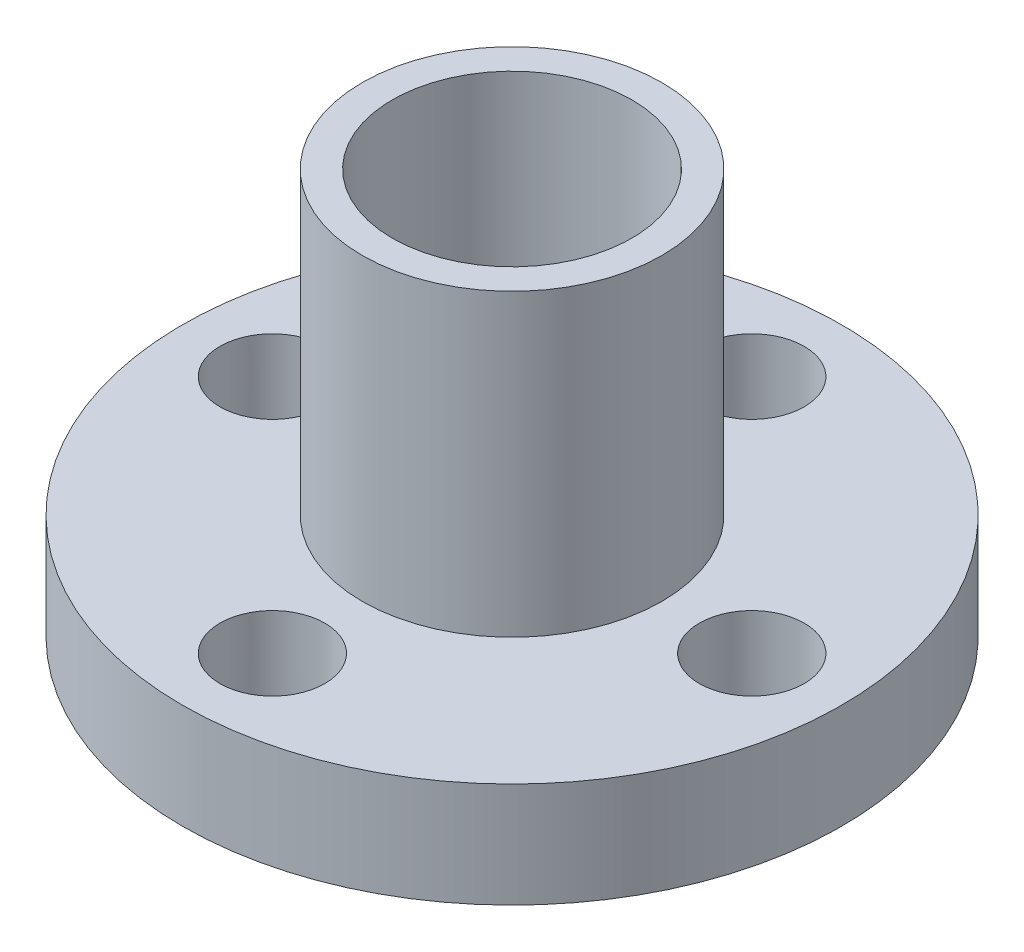
ISO-10303-21;
HEADER;
FILE_DESCRIPTION(('STEP AP214'),'2;1');
FILE_NAME('part.step','',(''),(''),'','','');
FILE_SCHEMA(('AUTOMOTIVE_DESIGN { 1 0 10303 214 1 1 1 1 }'));
ENDSEC;
DATA;
#1=APPLICATION_CONTEXT('core data for automotive mechanical design processes');
#2=APPLICATION_PROTOCOL_DEFINITION('international standard','automotive_design',2000,#1);
#3=PRODUCT_CONTEXT('',#1,'mechanical');
#4=PRODUCT('Part','Part','',(#3));
#5=PRODUCT_RELATED_PRODUCT_CATEGORY('part','',(#4));
#6=PRODUCT_DEFINITION_FORMATION('','',#4);
#7=PRODUCT_DEFINITION_CONTEXT('part definition',#1,'design');
#8=PRODUCT_DEFINITION('design','',#6,#7);
#9=PRODUCT_DEFINITION_SHAPE('','',#8);
#10=(LENGTH_UNIT() NAMED_UNIT(*) SI_UNIT(.MILLI.,.METRE.));
#11=(NAMED_UNIT(*) PLANE_ANGLE_UNIT() SI_UNIT($,.RADIAN.));
#12=(NAMED_UNIT(*) SI_UNIT($,.STERADIAN.) SOLID_ANGLE_UNIT());
#13=UNCERTAINTY_MEASURE_WITH_UNIT(LENGTH_MEASURE(1.E-05),#10,'distance_accuracy_value','');
#14=(GEOMETRIC_REPRESENTATION_CONTEXT(3) GLOBAL_UNCERTAINTY_ASSIGNED_CONTEXT((#13)) GLOBAL_UNIT_ASSIGNED_CONTEXT((#10,
#11,#12)) REPRESENTATION_CONTEXT('',''));
#15=CARTESIAN_POINT('',(0.,0.,0.));
#16=DIRECTION('',(0.,0.,1.));
#17=DIRECTION('',(1.,0.,0.));
#18=AXIS2_PLACEMENT_3D('',#15,#16,#17);
#19=CARTESIAN_POINT('',(0.,1.5,0.));
#20=DIRECTION('',(0.,-1.,0.));
#21=DIRECTION('',(0.,0.,-1.));
#22=AXIS2_PLACEMENT_3D('',#19,#20,#21);
#23=CYLINDRICAL_SURFACE('',#22,5.);
#24=CARTESIAN_POINT('',(0.,1.5,0.));
#25=DIRECTION('',(0.,1.,0.));
#26=DIRECTION('',(0.,0.,1.));
#27=AXIS2_PLACEMENT_3D('',#24,#25,#26);
#28=CIRCLE('',#27,5.);
#29=CARTESIAN_POINT('',(0.,1.5,5.));
#30=VERTEX_POINT('',#29);
#31=EDGE_CURVE('E45',#30,#30,#28,.T.);
#32=ORIENTED_EDGE('',*,*,#31,.F.);
#33=EDGE_LOOP('',(#32));
#34=FACE_BOUND('',#33,.T.);
#35=CARTESIAN_POINT('',(0.,0.,0.));
#36=DIRECTION('',(0.,1.,0.));
#37=DIRECTION('',(0.,0.,1.));
#38=AXIS2_PLACEMENT_3D('',#35,#36,#37);
#39=CIRCLE('',#38,5.);
#40=CARTESIAN_POINT('',(0.,0.,5.));
#41=VERTEX_POINT('',#40);
#42=EDGE_CURVE('E51',#41,#41,#39,.T.);
#43=ORIENTED_EDGE('',*,*,#42,.T.);
#44=EDGE_LOOP('',(#43));
#45=FACE_BOUND('',#44,.T.);
#46=ADVANCED_FACE('F37',(#34,#45),#23,.T.);
#47=CARTESIAN_POINT('',(0.,0.,0.));
#48=DIRECTION('',(0.,1.,0.));
#49=DIRECTION('',(0.,0.,1.));
#50=AXIS2_PLACEMENT_3D('',#47,#48,#49);
#51=PLANE('',#50);
#52=CARTESIAN_POINT('',(0.,0.,0.));
#53=DIRECTION('',(0.,-1.,0.));
#54=DIRECTION('',(0.,0.,-1.));
#55=AXIS2_PLACEMENT_3D('',#52,#53,#54);
#56=CIRCLE('',#55,4.);
#57=CARTESIAN_POINT('',(0.,0.,-4.));
#58=VERTEX_POINT('',#57);
#59=EDGE_CURVE('E154',#58,#58,#56,.T.);
#60=ORIENTED_EDGE('',*,*,#59,.F.);
#61=EDGE_LOOP('',(#60));
#62=FACE_BOUND('',#61,.T.);
#63=ORIENTED_EDGE('',*,*,#42,.F.);
#64=EDGE_LOOP('',(#63));
#65=FACE_BOUND('',#64,.T.);
#66=ADVANCED_FACE('F69',(#62,#65),#51,.F.);
#67=CARTESIAN_POINT('',(0.,5.,0.));
#68=DIRECTION('',(0.,-1.,0.));
#69=DIRECTION('',(0.,0.,-1.));
#70=AXIS2_PLACEMENT_3D('',#67,#68,#69);
#71=CYLINDRICAL_SURFACE('',#70,11.);
#72=CARTESIAN_POINT('',(0.,5.,0.));
#73=DIRECTION('',(0.,1.,0.));
#74=DIRECTION('',(0.,0.,1.));
#75=AXIS2_PLACEMENT_3D('',#72,#73,#74);
#76=CIRCLE('',#75,11.);
#77=CARTESIAN_POINT('',(0.,5.,11.));
#78=VERTEX_POINT('',#77);
#79=EDGE_CURVE('E57',#78,#78,#76,.T.);
#80=ORIENTED_EDGE('',*,*,#79,.F.);
#81=EDGE_LOOP('',(#80));
#82=FACE_BOUND('',#81,.T.);
#83=CARTESIAN_POINT('',(0.,1.5,0.));
#84=DIRECTION('',(0.,1.,0.));
#85=DIRECTION('',(0.,0.,1.));
#86=AXIS2_PLACEMENT_3D('',#83,#84,#85);
#87=CIRCLE('',#86,11.);
#88=CARTESIAN_POINT('',(0.,1.5,11.));
#89=VERTEX_POINT('',#88);
#90=EDGE_CURVE('E61',#89,#89,#87,.T.);
#91=ORIENTED_EDGE('',*,*,#90,.T.);
#92=EDGE_LOOP('',(#91));
#93=FACE_BOUND('',#92,.T.);
#94=ADVANCED_FACE('F71',(#82,#93),#71,.T.);
#95=CARTESIAN_POINT('',(0.,5.,0.));
#96=DIRECTION('',(0.,1.,0.));
#97=DIRECTION('',(0.,0.,1.));
#98=AXIS2_PLACEMENT_3D('',#95,#96,#97);
#99=PLANE('',#98);
#100=CARTESIAN_POINT('',(8.,5.,0.));
#101=DIRECTION('',(0.,1.,0.));
#102=DIRECTION('',(0.,0.,1.));
#103=AXIS2_PLACEMENT_3D('',#100,#101,#102);
#104=CIRCLE('',#103,1.75);
#105=CARTESIAN_POINT('',(8.,5.,1.75));
#106=VERTEX_POINT('',#105);
#107=EDGE_CURVE('E122',#106,#106,#104,.T.);
#108=ORIENTED_EDGE('',*,*,#107,.F.);
#109=EDGE_LOOP('',(#108));
#110=FACE_BOUND('',#109,.T.);
#111=CARTESIAN_POINT('',(0.,5.,-8.));
#112=DIRECTION('',(0.,1.,0.));
#113=DIRECTION('',(0.,0.,1.));
#114=AXIS2_PLACEMENT_3D('',#111,#112,#113);
#115=CIRCLE('',#114,1.75);
#116=CARTESIAN_POINT('',(0.,5.,-6.25));
#117=VERTEX_POINT('',#116);
#118=EDGE_CURVE('E149',#117,#117,#115,.T.);
#119=ORIENTED_EDGE('',*,*,#118,.F.);
#120=EDGE_LOOP('',(#119));
#121=FACE_BOUND('',#120,.T.);
#122=CARTESIAN_POINT('',(-8.,5.,0.));
#123=DIRECTION('',(0.,1.,0.));
#124=DIRECTION('',(0.,0.,1.));
#125=AXIS2_PLACEMENT_3D('',#122,#123,#124);
#126=CIRCLE('',#125,1.75);
#127=CARTESIAN_POINT('',(-8.,5.,1.75));
#128=VERTEX_POINT('',#127);
#129=EDGE_CURVE('E133',#128,#128,#126,.T.);
#130=ORIENTED_EDGE('',*,*,#129,.F.);
#131=EDGE_LOOP('',(#130));
#132=FACE_BOUND('',#131,.T.);
#133=CARTESIAN_POINT('',(0.,5.,8.));
#134=DIRECTION('',(0.,1.,0.));
#135=DIRECTION('',(0.,0.,1.));
#136=AXIS2_PLACEMENT_3D('',#133,#134,#135);
#137=CIRCLE('',#136,1.75);
#138=CARTESIAN_POINT('',(0.,5.,9.75));
#139=VERTEX_POINT('',#138);
#140=EDGE_CURVE('E127',#139,#139,#137,.T.);
#141=ORIENTED_EDGE('',*,*,#140,.F.);
#142=EDGE_LOOP('',(#141));
#143=FACE_BOUND('',#142,.T.);
#144=CARTESIAN_POINT('',(0.,5.,0.));
#145=DIRECTION('',(0.,1.,0.));
#146=DIRECTION('',(0.,0.,1.));
#147=AXIS2_PLACEMENT_3D('',#144,#145,#146);
#148=CIRCLE('',#147,5.);
#149=CARTESIAN_POINT('',(0.,5.,5.));
#150=VERTEX_POINT('',#149);
#151=EDGE_CURVE('E10',#150,#150,#148,.T.);
#152=ORIENTED_EDGE('',*,*,#151,.F.);
#153=EDGE_LOOP('',(#152));
#154=FACE_BOUND('',#153,.T.);
#155=ORIENTED_EDGE('',*,*,#79,.T.);
#156=EDGE_LOOP('',(#155));
#157=FACE_BOUND('',#156,.T.);
#158=ADVANCED_FACE('F77',(#110,#121,#132,#143,#154,#157),#99,.T.);
#159=CARTESIAN_POINT('',(0.,1.5,0.));
#160=DIRECTION('',(0.,1.,0.));
#161=DIRECTION('',(0.,0.,1.));
#162=AXIS2_PLACEMENT_3D('',#159,#160,#161);
#163=PLANE('',#162);
#164=CARTESIAN_POINT('',(8.,1.5,0.));
#165=DIRECTION('',(0.,-1.,0.));
#166=DIRECTION('',(0.,0.,-1.));
#167=AXIS2_PLACEMENT_3D('',#164,#165,#166);
#168=CIRCLE('',#167,1.75);
#169=CARTESIAN_POINT('',(8.,1.5,-1.75));
#170=VERTEX_POINT('',#169);
#171=EDGE_CURVE('E125',#170,#170,#168,.T.);
#172=ORIENTED_EDGE('',*,*,#171,.F.);
#173=EDGE_LOOP('',(#172));
#174=FACE_BOUND('',#173,.T.);
#175=CARTESIAN_POINT('',(0.,1.5,-8.));
#176=DIRECTION('',(0.,-1.,0.));
#177=DIRECTION('',(0.,0.,-1.));
#178=AXIS2_PLACEMENT_3D('',#175,#176,#177);
#179=CIRCLE('',#178,1.75);
#180=CARTESIAN_POINT('',(0.,1.5,-9.75));
#181=VERTEX_POINT('',#180);
#182=EDGE_CURVE('E128',#181,#181,#179,.T.);
#183=ORIENTED_EDGE('',*,*,#182,.F.);
#184=EDGE_LOOP('',(#183));
#185=FACE_BOUND('',#184,.T.);
#186=CARTESIAN_POINT('',(-8.,1.5,0.));
#187=DIRECTION('',(0.,-1.,0.));
#188=DIRECTION('',(0.,0.,-1.));
#189=AXIS2_PLACEMENT_3D('',#186,#187,#188);
#190=CIRCLE('',#189,1.75);
#191=CARTESIAN_POINT('',(-8.,1.5,-1.75));
#192=VERTEX_POINT('',#191);
#193=EDGE_CURVE('E136',#192,#192,#190,.T.);
#194=ORIENTED_EDGE('',*,*,#193,.F.);
#195=EDGE_LOOP('',(#194));
#196=FACE_BOUND('',#195,.T.);
#197=CARTESIAN_POINT('',(0.,1.5,8.));
#198=DIRECTION('',(0.,-1.,0.));
#199=DIRECTION('',(0.,0.,-1.));
#200=AXIS2_PLACEMENT_3D('',#197,#198,#199);
#201=CIRCLE('',#200,1.75);
#202=CARTESIAN_POINT('',(0.,1.5,6.25));
#203=VERTEX_POINT('',#202);
#204=EDGE_CURVE('E142',#203,#203,#201,.T.);
#205=ORIENTED_EDGE('',*,*,#204,.F.);
#206=EDGE_LOOP('',(#205));
#207=FACE_BOUND('',#206,.T.);
#208=ORIENTED_EDGE('',*,*,#31,.T.);
#209=EDGE_LOOP('',(#208));
#210=FACE_BOUND('',#209,.T.);
#211=ORIENTED_EDGE('',*,*,#90,.F.);
#212=EDGE_LOOP('',(#211));
#213=FACE_BOUND('',#212,.T.);
#214=ADVANCED_FACE('F83',(#174,#185,#196,#207,#210,#213),#163,.F.);
#215=CARTESIAN_POINT('',(0.,15.,0.));
#216=DIRECTION('',(0.,-1.,0.));
#217=DIRECTION('',(0.,0.,-1.));
#218=AXIS2_PLACEMENT_3D('',#215,#216,#217);
#219=CYLINDRICAL_SURFACE('',#218,5.);
#220=CARTESIAN_POINT('',(0.,15.,0.));
#221=DIRECTION('',(0.,1.,0.));
#222=DIRECTION('',(0.,0.,1.));
#223=AXIS2_PLACEMENT_3D('',#220,#221,#222);
#224=CIRCLE('',#223,5.);
#225=CARTESIAN_POINT('',(0.,15.,5.));
#226=VERTEX_POINT('',#225);
#227=EDGE_CURVE('E55',#226,#226,#224,.T.);
#228=ORIENTED_EDGE('',*,*,#227,.F.);
#229=EDGE_LOOP('',(#228));
#230=FACE_BOUND('',#229,.T.);
#231=ORIENTED_EDGE('',*,*,#151,.T.);
#232=EDGE_LOOP('',(#231));
#233=FACE_BOUND('',#232,.T.);
#234=ADVANCED_FACE('F86',(#230,#233),#219,.T.);
#235=CARTESIAN_POINT('',(0.,15.,0.));
#236=DIRECTION('',(0.,1.,0.));
#237=DIRECTION('',(0.,0.,1.));
#238=AXIS2_PLACEMENT_3D('',#235,#236,#237);
#239=PLANE('',#238);
#240=CARTESIAN_POINT('',(0.,15.,0.));
#241=DIRECTION('',(0.,1.,0.));
#242=DIRECTION('',(0.,0.,1.));
#243=AXIS2_PLACEMENT_3D('',#240,#241,#242);
#244=CIRCLE('',#243,4.);
#245=CARTESIAN_POINT('',(0.,15.,4.));
#246=VERTEX_POINT('',#245);
#247=EDGE_CURVE('E40',#246,#246,#244,.T.);
#248=ORIENTED_EDGE('',*,*,#247,.F.);
#249=EDGE_LOOP('',(#248));
#250=FACE_BOUND('',#249,.T.);
#251=ORIENTED_EDGE('',*,*,#227,.T.);
#252=EDGE_LOOP('',(#251));
#253=FACE_BOUND('',#252,.T.);
#254=ADVANCED_FACE('F93',(#250,#253),#239,.T.);
#255=CARTESIAN_POINT('',(0.,16.,0.));
#256=DIRECTION('',(0.,-1.,0.));
#257=DIRECTION('',(0.,0.,-1.));
#258=AXIS2_PLACEMENT_3D('',#255,#256,#257);
#259=CYLINDRICAL_SURFACE('',#258,4.);
#260=ORIENTED_EDGE('',*,*,#247,.T.);
#261=EDGE_LOOP('',(#260));
#262=FACE_BOUND('',#261,.T.);
#263=ORIENTED_EDGE('',*,*,#59,.T.);
#264=EDGE_LOOP('',(#263));
#265=FACE_BOUND('',#264,.T.);
#266=ADVANCED_FACE('F97',(#262,#265),#259,.F.);
#267=CARTESIAN_POINT('',(0.,17.5,8.));
#268=DIRECTION('',(0.,-1.,0.));
#269=DIRECTION('',(0.,0.,-1.));
#270=AXIS2_PLACEMENT_3D('',#267,#268,#269);
#271=CYLINDRICAL_SURFACE('',#270,1.75);
#272=ORIENTED_EDGE('',*,*,#140,.T.);
#273=EDGE_LOOP('',(#272));
#274=FACE_BOUND('',#273,.T.);
#275=ORIENTED_EDGE('',*,*,#204,.T.);
#276=EDGE_LOOP('',(#275));
#277=FACE_BOUND('',#276,.T.);
#278=ADVANCED_FACE('F101',(#274,#277),#271,.F.);
#279=CARTESIAN_POINT('',(-8.,17.5,0.));
#280=DIRECTION('',(0.,-1.,0.));
#281=DIRECTION('',(0.,0.,-1.));
#282=AXIS2_PLACEMENT_3D('',#279,#280,#281);
#283=CYLINDRICAL_SURFACE('',#282,1.75);
#284=ORIENTED_EDGE('',*,*,#129,.T.);
#285=EDGE_LOOP('',(#284));
#286=FACE_BOUND('',#285,.T.);
#287=ORIENTED_EDGE('',*,*,#193,.T.);
#288=EDGE_LOOP('',(#287));
#289=FACE_BOUND('',#288,.T.);
#290=ADVANCED_FACE('F105',(#286,#289),#283,.F.);
#291=CARTESIAN_POINT('',(0.,17.5,-8.));
#292=DIRECTION('',(0.,-1.,0.));
#293=DIRECTION('',(0.,0.,-1.));
#294=AXIS2_PLACEMENT_3D('',#291,#292,#293);
#295=CYLINDRICAL_SURFACE('',#294,1.75);
#296=ORIENTED_EDGE('',*,*,#118,.T.);
#297=EDGE_LOOP('',(#296));
#298=FACE_BOUND('',#297,.T.);
#299=ORIENTED_EDGE('',*,*,#182,.T.);
#300=EDGE_LOOP('',(#299));
#301=FACE_BOUND('',#300,.T.);
#302=ADVANCED_FACE('F109',(#298,#301),#295,.F.);
#303=CARTESIAN_POINT('',(8.,17.5,0.));
#304=DIRECTION('',(0.,-1.,0.));
#305=DIRECTION('',(0.,0.,-1.));
#306=AXIS2_PLACEMENT_3D('',#303,#304,#305);
#307=CYLINDRICAL_SURFACE('',#306,1.75);
#308=ORIENTED_EDGE('',*,*,#107,.T.);
#309=EDGE_LOOP('',(#308));
#310=FACE_BOUND('',#309,.T.);
#311=ORIENTED_EDGE('',*,*,#171,.T.);
#312=EDGE_LOOP('',(#311));
#313=FACE_BOUND('',#312,.T.);
#314=ADVANCED_FACE('F113',(#310,#313),#307,.F.);
#315=CLOSED_SHELL('',(#46,#66,#94,#158,#214,#234,#254,#266,#278,#290,#302,#314));
#316=MANIFOLD_SOLID_BREP('B2',#315);
#317=ADVANCED_BREP_SHAPE_REPRESENTATION('',(#18,#316),#14);
#318=SHAPE_DEFINITION_REPRESENTATION(#9,#317);
ENDSEC;
END-ISO-10303-21;
